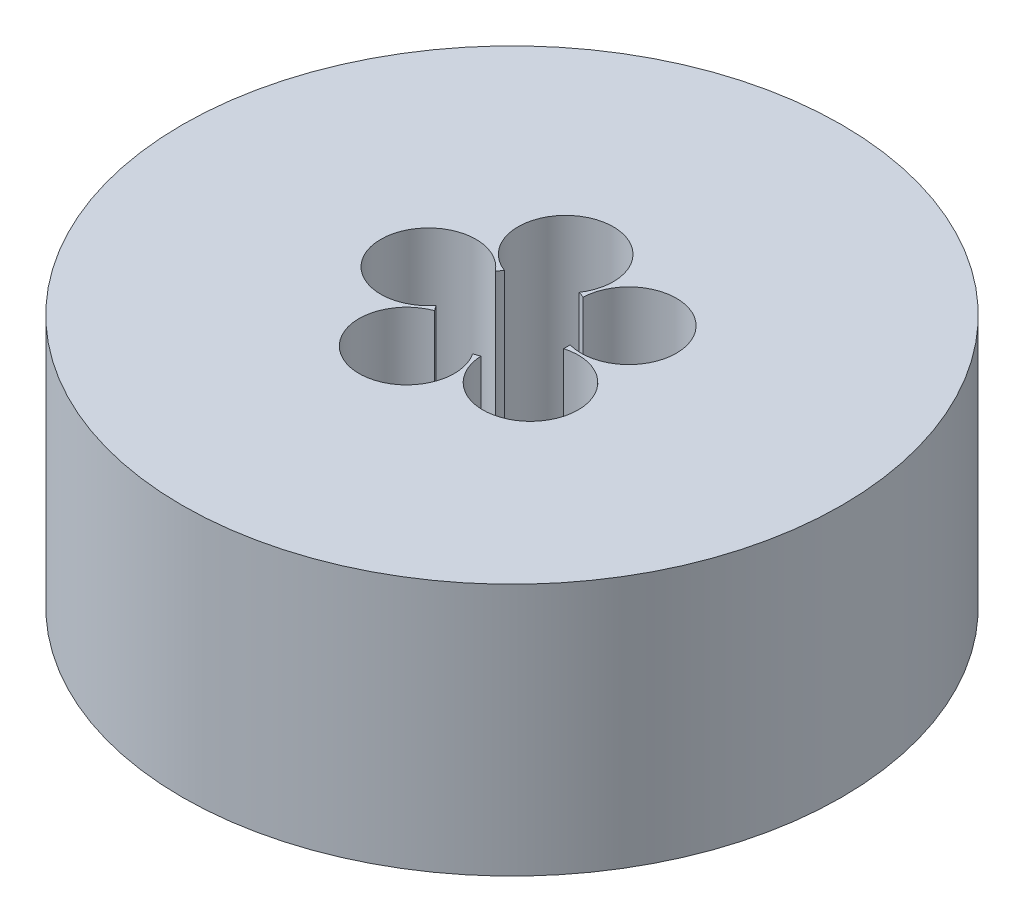
ISO-10303-21;
HEADER;
FILE_DESCRIPTION(('STEP AP214'),'2;1');
FILE_NAME('part.step','',(''),(''),'','','');
FILE_SCHEMA(('AUTOMOTIVE_DESIGN { 1 0 10303 214 1 1 1 1 }'));
ENDSEC;
DATA;
#1=APPLICATION_CONTEXT('core data for automotive mechanical design processes');
#2=APPLICATION_PROTOCOL_DEFINITION('international standard','automotive_design',2000,#1);
#3=PRODUCT_CONTEXT('',#1,'mechanical');
#4=PRODUCT('Part','Part','',(#3));
#5=PRODUCT_RELATED_PRODUCT_CATEGORY('part','',(#4));
#6=PRODUCT_DEFINITION_FORMATION('','',#4);
#7=PRODUCT_DEFINITION_CONTEXT('part definition',#1,'design');
#8=PRODUCT_DEFINITION('design','',#6,#7);
#9=PRODUCT_DEFINITION_SHAPE('','',#8);
#10=(LENGTH_UNIT() NAMED_UNIT(*) SI_UNIT(.MILLI.,.METRE.));
#11=(NAMED_UNIT(*) PLANE_ANGLE_UNIT() SI_UNIT($,.RADIAN.));
#12=(NAMED_UNIT(*) SI_UNIT($,.STERADIAN.) SOLID_ANGLE_UNIT());
#13=UNCERTAINTY_MEASURE_WITH_UNIT(LENGTH_MEASURE(1.E-05),#10,'distance_accuracy_value','');
#14=(GEOMETRIC_REPRESENTATION_CONTEXT(3) GLOBAL_UNCERTAINTY_ASSIGNED_CONTEXT((#13)) GLOBAL_UNIT_ASSIGNED_CONTEXT((#10,
#11,#12)) REPRESENTATION_CONTEXT('',''));
#15=CARTESIAN_POINT('',(0.,0.,0.));
#16=DIRECTION('',(0.,0.,1.));
#17=DIRECTION('',(1.,0.,0.));
#18=AXIS2_PLACEMENT_3D('',#15,#16,#17);
#19=CARTESIAN_POINT('',(0.,23.,0.));
#20=DIRECTION('',(0.,-1.,0.));
#21=DIRECTION('',(0.,0.,-1.));
#22=AXIS2_PLACEMENT_3D('',#19,#20,#21);
#23=CYLINDRICAL_SURFACE('',#22,30.);
#24=CARTESIAN_POINT('',(0.,23.,0.));
#25=DIRECTION('',(0.,1.,0.));
#26=DIRECTION('',(0.,0.,1.));
#27=AXIS2_PLACEMENT_3D('',#24,#25,#26);
#28=CIRCLE('',#27,30.);
#29=CARTESIAN_POINT('',(0.,23.,30.));
#30=VERTEX_POINT('',#29);
#31=EDGE_CURVE('E156',#30,#30,#28,.T.);
#32=ORIENTED_EDGE('',*,*,#31,.F.);
#33=EDGE_LOOP('',(#32));
#34=FACE_BOUND('',#33,.T.);
#35=CARTESIAN_POINT('',(0.,0.,0.));
#36=DIRECTION('',(0.,1.,0.));
#37=DIRECTION('',(0.,0.,1.));
#38=AXIS2_PLACEMENT_3D('',#35,#36,#37);
#39=CIRCLE('',#38,30.);
#40=CARTESIAN_POINT('',(0.,0.,30.));
#41=VERTEX_POINT('',#40);
#42=EDGE_CURVE('E145',#41,#41,#39,.T.);
#43=ORIENTED_EDGE('',*,*,#42,.T.);
#44=EDGE_LOOP('',(#43));
#45=FACE_BOUND('',#44,.T.);
#46=ADVANCED_FACE('F39',(#34,#45),#23,.T.);
#47=CARTESIAN_POINT('',(0.,23.,0.));
#48=DIRECTION('',(0.,1.,0.));
#49=DIRECTION('',(0.,0.,1.));
#50=AXIS2_PLACEMENT_3D('',#47,#48,#49);
#51=PLANE('',#50);
#52=CARTESIAN_POINT('',(6.15396144379872,23.,4.47111470462499));
#53=DIRECTION('',(0.,1.,0.));
#54=DIRECTION('',(0.587785252292469,0.,-0.809016994374951));
#55=AXIS2_PLACEMENT_3D('',#52,#53,#54);
#56=CIRCLE('',#55,4.33494273029872);
#57=CARTESIAN_POINT('',(1.82295628744294,23.,4.65583831055936));
#58=VERTEX_POINT('',#57);
#59=CARTESIAN_POINT('',(4.99128983689663,23.,0.29500129506899));
#60=VERTEX_POINT('',#59);
#61=EDGE_CURVE('E139',#58,#60,#56,.T.);
#62=ORIENTED_EDGE('',*,*,#61,.F.);
#63=CARTESIAN_POINT('',(0.,23.,0.));
#64=DIRECTION('',(0.,1.,0.));
#65=DIRECTION('',(0.,0.,1.));
#66=AXIS2_PLACEMENT_3D('',#63,#64,#65);
#67=CIRCLE('',#66,5.);
#68=CARTESIAN_POINT('',(1.26183047946113,23.,4.83815913763726));
#69=VERTEX_POINT('',#68);
#70=EDGE_CURVE('E132',#69,#58,#67,.T.);
#71=ORIENTED_EDGE('',*,*,#70,.F.);
#72=CARTESIAN_POINT('',(-2.35060410607471,23.,7.23441555968274));
#73=DIRECTION('',(0.,1.,0.));
#74=DIRECTION('',(0.951056516295155,0.,0.309016994374945));
#75=AXIS2_PLACEMENT_3D('',#72,#73,#74);
#76=CIRCLE('',#75,4.33494273029872);
#77=CARTESIAN_POINT('',(-3.86464089125158,23.,3.17246761711861));
#78=VERTEX_POINT('',#77);
#79=EDGE_CURVE('E111',#78,#69,#76,.T.);
#80=ORIENTED_EDGE('',*,*,#79,.F.);
#81=CARTESIAN_POINT('',(-4.21143571254908,23.,2.69514549497169));
#82=VERTEX_POINT('',#81);
#83=EDGE_CURVE('E143',#82,#78,#67,.T.);
#84=ORIENTED_EDGE('',*,*,#83,.F.);
#85=CARTESIAN_POINT('',(-7.60671467544794,23.,0.));
#86=DIRECTION('',(0.,1.,0.));
#87=DIRECTION('',(0.,0.,1.));
#88=AXIS2_PLACEMENT_3D('',#85,#86,#87);
#89=CIRCLE('',#88,4.33494273029872);
#90=CARTESIAN_POINT('',(-4.21143571254908,23.,-2.69514549497169));
#91=VERTEX_POINT('',#90);
#92=EDGE_CURVE('E147',#91,#82,#89,.T.);
#93=ORIENTED_EDGE('',*,*,#92,.F.);
#94=CARTESIAN_POINT('',(-3.86464089125162,23.,-3.17246761711855));
#95=VERTEX_POINT('',#94);
#96=EDGE_CURVE('E144',#95,#91,#67,.T.);
#97=ORIENTED_EDGE('',*,*,#96,.F.);
#98=CARTESIAN_POINT('',(-2.35060410607481,23.,-7.23441555968271));
#99=DIRECTION('',(0.,1.,0.));
#100=DIRECTION('',(-0.95105651629515,0.,0.309016994374958));
#101=AXIS2_PLACEMENT_3D('',#98,#99,#100);
#102=CIRCLE('',#101,4.33494273029872);
#103=CARTESIAN_POINT('',(1.26183047946106,23.,-4.83815913763728));
#104=VERTEX_POINT('',#103);
#105=EDGE_CURVE('E326',#104,#95,#102,.T.);
#106=ORIENTED_EDGE('',*,*,#105,.F.);
#107=CARTESIAN_POINT('',(1.82295628744288,23.,-4.65583831055939));
#108=VERTEX_POINT('',#107);
#109=EDGE_CURVE('E150',#108,#104,#67,.T.);
#110=ORIENTED_EDGE('',*,*,#109,.F.);
#111=CARTESIAN_POINT('',(6.15396144379866,23.,-4.47111470462508));
#112=DIRECTION('',(0.,1.,0.));
#113=DIRECTION('',(-0.58778525229248,0.,-0.809016994374942));
#114=AXIS2_PLACEMENT_3D('',#111,#112,#113);
#115=CIRCLE('',#114,4.33494273029872);
#116=CARTESIAN_POINT('',(4.99128983689663,23.,-0.295001295069062));
#117=VERTEX_POINT('',#116);
#118=EDGE_CURVE('E341',#117,#108,#115,.T.);
#119=ORIENTED_EDGE('',*,*,#118,.F.);
#120=EDGE_CURVE('E142',#60,#117,#67,.T.);
#121=ORIENTED_EDGE('',*,*,#120,.F.);
#122=EDGE_LOOP('',(#62,#71,#80,#84,#93,#97,#106,#110,#119,#121));
#123=FACE_BOUND('',#122,.T.);
#124=ORIENTED_EDGE('',*,*,#31,.T.);
#125=EDGE_LOOP('',(#124));
#126=FACE_BOUND('',#125,.T.);
#127=ADVANCED_FACE('F140',(#123,#126),#51,.T.);
#128=CARTESIAN_POINT('',(0.,0.,0.));
#129=DIRECTION('',(0.,1.,0.));
#130=DIRECTION('',(0.,0.,1.));
#131=AXIS2_PLACEMENT_3D('',#128,#129,#130);
#132=PLANE('',#131);
#133=CARTESIAN_POINT('',(0.,0.,0.));
#134=DIRECTION('',(0.,1.,0.));
#135=DIRECTION('',(0.,0.,1.));
#136=AXIS2_PLACEMENT_3D('',#133,#134,#135);
#137=CIRCLE('',#136,5.);
#138=CARTESIAN_POINT('',(0.,0.,5.));
#139=VERTEX_POINT('',#138);
#140=EDGE_CURVE('E155',#139,#139,#137,.T.);
#141=ORIENTED_EDGE('',*,*,#140,.T.);
#142=EDGE_LOOP('',(#141));
#143=FACE_BOUND('',#142,.T.);
#144=ORIENTED_EDGE('',*,*,#42,.F.);
#145=EDGE_LOOP('',(#144));
#146=FACE_BOUND('',#145,.T.);
#147=ADVANCED_FACE('F210',(#143,#146),#132,.F.);
#148=CARTESIAN_POINT('',(0.,23.,0.));
#149=DIRECTION('',(0.,-1.,0.));
#150=DIRECTION('',(0.,0.,-1.));
#151=AXIS2_PLACEMENT_3D('',#148,#149,#150);
#152=CYLINDRICAL_SURFACE('',#151,5.);
#153=DIRECTION('',(0.,1.,0.));
#154=VECTOR('',#153,1.);
#155=CARTESIAN_POINT('',(1.82295628744294,12.9826758487099,4.65583831055936));
#156=LINE('',#155,#154);
#157=CARTESIAN_POINT('',(1.82295628744294,2.96535169741985,4.65583831055936));
#158=VERTEX_POINT('',#157);
#159=EDGE_CURVE('E11',#158,#58,#156,.T.);
#160=ORIENTED_EDGE('',*,*,#159,.F.);
#161=CARTESIAN_POINT('',(0.,2.96535169741985,0.));
#162=DIRECTION('',(0.,1.,0.));
#163=DIRECTION('',(0.,0.,1.));
#164=AXIS2_PLACEMENT_3D('',#161,#162,#163);
#165=CIRCLE('',#164,5.);
#166=CARTESIAN_POINT('',(4.99128983689663,2.96535169741985,0.29500129506899));
#167=VERTEX_POINT('',#166);
#168=EDGE_CURVE('E190',#158,#167,#165,.T.);
#169=ORIENTED_EDGE('',*,*,#168,.T.);
#170=DIRECTION('',(0.,1.,0.));
#171=VECTOR('',#170,1.);
#172=CARTESIAN_POINT('',(4.99128983689663,12.9826758487099,0.29500129506899));
#173=LINE('',#172,#171);
#174=EDGE_CURVE('E46',#60,#167,#173,.F.);
#175=ORIENTED_EDGE('',*,*,#174,.F.);
#176=ORIENTED_EDGE('',*,*,#120,.T.);
#177=DIRECTION('',(0.,1.,0.));
#178=VECTOR('',#177,1.);
#179=CARTESIAN_POINT('',(4.99128983689663,12.9826758487099,-0.295001295069062));
#180=LINE('',#179,#178);
#181=CARTESIAN_POINT('',(4.99128983689663,2.96535169741985,-0.295001295069062));
#182=VERTEX_POINT('',#181);
#183=EDGE_CURVE('E183',#182,#117,#180,.T.);
#184=ORIENTED_EDGE('',*,*,#183,.F.);
#185=CARTESIAN_POINT('',(0.,2.96535169741985,0.));
#186=DIRECTION('',(0.,1.,0.));
#187=DIRECTION('',(0.,0.,1.));
#188=AXIS2_PLACEMENT_3D('',#185,#186,#187);
#189=CIRCLE('',#188,5.);
#190=CARTESIAN_POINT('',(1.82295628744288,2.96535169741985,-4.65583831055939));
#191=VERTEX_POINT('',#190);
#192=EDGE_CURVE('E179',#182,#191,#189,.T.);
#193=ORIENTED_EDGE('',*,*,#192,.T.);
#194=DIRECTION('',(0.,1.,0.));
#195=VECTOR('',#194,1.);
#196=CARTESIAN_POINT('',(1.82295628744288,12.9826758487099,-4.65583831055939));
#197=LINE('',#196,#195);
#198=EDGE_CURVE('E181',#108,#191,#197,.F.);
#199=ORIENTED_EDGE('',*,*,#198,.F.);
#200=ORIENTED_EDGE('',*,*,#109,.T.);
#201=DIRECTION('',(0.,1.,0.));
#202=VECTOR('',#201,1.);
#203=CARTESIAN_POINT('',(1.26183047946107,12.9826758487099,-4.83815913763728));
#204=LINE('',#203,#202);
#205=CARTESIAN_POINT('',(1.26183047946106,2.96535169741985,-4.83815913763728));
#206=VERTEX_POINT('',#205);
#207=EDGE_CURVE('E177',#206,#104,#204,.T.);
#208=ORIENTED_EDGE('',*,*,#207,.F.);
#209=CARTESIAN_POINT('',(0.,2.96535169741985,0.));
#210=DIRECTION('',(0.,1.,0.));
#211=DIRECTION('',(0.,0.,1.));
#212=AXIS2_PLACEMENT_3D('',#209,#210,#211);
#213=CIRCLE('',#212,5.);
#214=CARTESIAN_POINT('',(-3.86464089125162,2.96535169741985,-3.17246761711855));
#215=VERTEX_POINT('',#214);
#216=EDGE_CURVE('E175',#206,#215,#213,.T.);
#217=ORIENTED_EDGE('',*,*,#216,.T.);
#218=DIRECTION('',(0.,1.,0.));
#219=VECTOR('',#218,1.);
#220=CARTESIAN_POINT('',(-3.86464089125162,12.9826758487099,-3.17246761711855));
#221=LINE('',#220,#219);
#222=EDGE_CURVE('E174',#95,#215,#221,.F.);
#223=ORIENTED_EDGE('',*,*,#222,.F.);
#224=ORIENTED_EDGE('',*,*,#96,.T.);
#225=DIRECTION('',(0.,1.,0.));
#226=VECTOR('',#225,1.);
#227=CARTESIAN_POINT('',(-4.21143571254908,12.9826758487099,-2.69514549497169));
#228=LINE('',#227,#226);
#229=CARTESIAN_POINT('',(-4.21143571254908,2.96535169741985,-2.69514549497169));
#230=VERTEX_POINT('',#229);
#231=EDGE_CURVE('E170',#230,#91,#228,.T.);
#232=ORIENTED_EDGE('',*,*,#231,.F.);
#233=CARTESIAN_POINT('',(0.,2.96535169741985,0.));
#234=DIRECTION('',(0.,1.,0.));
#235=DIRECTION('',(0.,0.,1.));
#236=AXIS2_PLACEMENT_3D('',#233,#234,#235);
#237=CIRCLE('',#236,5.);
#238=CARTESIAN_POINT('',(-4.21143571254908,2.96535169741985,2.69514549497169));
#239=VERTEX_POINT('',#238);
#240=EDGE_CURVE('E157',#230,#239,#237,.T.);
#241=ORIENTED_EDGE('',*,*,#240,.T.);
#242=DIRECTION('',(0.,1.,0.));
#243=VECTOR('',#242,1.);
#244=CARTESIAN_POINT('',(-4.21143571254908,12.9826758487099,2.69514549497169));
#245=LINE('',#244,#243);
#246=EDGE_CURVE('E163',#82,#239,#245,.F.);
#247=ORIENTED_EDGE('',*,*,#246,.F.);
#248=ORIENTED_EDGE('',*,*,#83,.T.);
#249=DIRECTION('',(0.,1.,0.));
#250=VECTOR('',#249,1.);
#251=CARTESIAN_POINT('',(-3.86464089125158,12.9826758487099,3.17246761711861));
#252=LINE('',#251,#250);
#253=CARTESIAN_POINT('',(-3.86464089125158,2.96535169741985,3.17246761711861));
#254=VERTEX_POINT('',#253);
#255=EDGE_CURVE('E121',#254,#78,#252,.T.);
#256=ORIENTED_EDGE('',*,*,#255,.F.);
#257=CARTESIAN_POINT('',(0.,2.96535169741985,0.));
#258=DIRECTION('',(0.,1.,0.));
#259=DIRECTION('',(0.,0.,1.));
#260=AXIS2_PLACEMENT_3D('',#257,#258,#259);
#261=CIRCLE('',#260,5.);
#262=CARTESIAN_POINT('',(1.26183047946113,2.96535169741985,4.83815913763726));
#263=VERTEX_POINT('',#262);
#264=EDGE_CURVE('E133',#254,#263,#261,.T.);
#265=ORIENTED_EDGE('',*,*,#264,.T.);
#266=DIRECTION('',(0.,1.,0.));
#267=VECTOR('',#266,1.);
#268=CARTESIAN_POINT('',(1.26183047946113,12.9826758487099,4.83815913763726));
#269=LINE('',#268,#267);
#270=EDGE_CURVE('E117',#69,#263,#269,.F.);
#271=ORIENTED_EDGE('',*,*,#270,.F.);
#272=ORIENTED_EDGE('',*,*,#70,.T.);
#273=EDGE_LOOP('',(#160,#169,#175,#176,#184,#193,#199,#200,#208,#217,#223,#224,#232,#241,#247,
#248,#256,#265,#271,#272));
#274=FACE_BOUND('',#273,.T.);
#275=ORIENTED_EDGE('',*,*,#140,.F.);
#276=EDGE_LOOP('',(#275));
#277=FACE_BOUND('',#276,.T.);
#278=ADVANCED_FACE('F131',(#274,#277),#152,.F.);
#279=CARTESIAN_POINT('',(-7.60671467544794,2.96535169741985,0.));
#280=DIRECTION('',(0.,1.,0.));
#281=DIRECTION('',(0.,0.,1.));
#282=AXIS2_PLACEMENT_3D('',#279,#280,#281);
#283=CYLINDRICAL_SURFACE('',#282,4.33494273029872);
#284=ORIENTED_EDGE('',*,*,#231,.T.);
#285=ORIENTED_EDGE('',*,*,#92,.T.);
#286=ORIENTED_EDGE('',*,*,#246,.T.);
#287=CARTESIAN_POINT('',(-7.60671467544794,2.96535169741985,0.));
#288=DIRECTION('',(0.,1.,0.));
#289=DIRECTION('',(0.,0.,1.));
#290=AXIS2_PLACEMENT_3D('',#287,#288,#289);
#291=CIRCLE('',#290,4.33494273029872);
#292=EDGE_CURVE('E154',#230,#239,#291,.T.);
#293=ORIENTED_EDGE('',*,*,#292,.F.);
#294=EDGE_LOOP('',(#284,#285,#286,#293));
#295=FACE_BOUND('',#294,.T.);
#296=ADVANCED_FACE('F217',(#295),#283,.F.);
#297=CARTESIAN_POINT('',(-7.60671467544794,2.96535169741985,0.));
#298=DIRECTION('',(0.,1.,0.));
#299=DIRECTION('',(0.,0.,1.));
#300=AXIS2_PLACEMENT_3D('',#297,#298,#299);
#301=PLANE('',#300);
#302=ORIENTED_EDGE('',*,*,#292,.T.);
#303=ORIENTED_EDGE('',*,*,#240,.F.);
#304=EDGE_LOOP('',(#302,#303));
#305=FACE_BOUND('',#304,.T.);
#306=ADVANCED_FACE('F225',(#305),#301,.T.);
#307=CARTESIAN_POINT('',(-2.35060410607471,2.96535169741985,7.23441555968274));
#308=DIRECTION('',(0.,1.,0.));
#309=DIRECTION('',(0.,0.,1.));
#310=AXIS2_PLACEMENT_3D('',#307,#308,#309);
#311=CYLINDRICAL_SURFACE('',#310,4.33494273029872);
#312=ORIENTED_EDGE('',*,*,#255,.T.);
#313=ORIENTED_EDGE('',*,*,#79,.T.);
#314=ORIENTED_EDGE('',*,*,#270,.T.);
#315=CARTESIAN_POINT('',(-2.35060410607471,2.96535169741985,7.23441555968274));
#316=DIRECTION('',(0.,1.,0.));
#317=DIRECTION('',(0.951056516295155,0.,0.309016994374945));
#318=AXIS2_PLACEMENT_3D('',#315,#316,#317);
#319=CIRCLE('',#318,4.33494273029872);
#320=EDGE_CURVE('E127',#254,#263,#319,.T.);
#321=ORIENTED_EDGE('',*,*,#320,.F.);
#322=EDGE_LOOP('',(#312,#313,#314,#321));
#323=FACE_BOUND('',#322,.T.);
#324=ADVANCED_FACE('F116',(#323),#311,.F.);
#325=CARTESIAN_POINT('',(-2.35060410607471,2.96535169741985,7.23441555968274));
#326=DIRECTION('',(0.,1.,0.));
#327=DIRECTION('',(0.951056516295155,0.,0.309016994374945));
#328=AXIS2_PLACEMENT_3D('',#325,#326,#327);
#329=PLANE('',#328);
#330=ORIENTED_EDGE('',*,*,#320,.T.);
#331=ORIENTED_EDGE('',*,*,#264,.F.);
#332=EDGE_LOOP('',(#330,#331));
#333=FACE_BOUND('',#332,.T.);
#334=ADVANCED_FACE('F228',(#333),#329,.T.);
#335=CARTESIAN_POINT('',(-2.35060410607481,2.96535169741985,-7.23441555968271));
#336=DIRECTION('',(0.,1.,0.));
#337=DIRECTION('',(0.,0.,1.));
#338=AXIS2_PLACEMENT_3D('',#335,#336,#337);
#339=CYLINDRICAL_SURFACE('',#338,4.33494273029872);
#340=ORIENTED_EDGE('',*,*,#207,.T.);
#341=ORIENTED_EDGE('',*,*,#105,.T.);
#342=ORIENTED_EDGE('',*,*,#222,.T.);
#343=CARTESIAN_POINT('',(-2.35060410607481,2.96535169741985,-7.23441555968271));
#344=DIRECTION('',(0.,1.,0.));
#345=DIRECTION('',(-0.95105651629515,0.,0.309016994374958));
#346=AXIS2_PLACEMENT_3D('',#343,#344,#345);
#347=CIRCLE('',#346,4.33494273029872);
#348=EDGE_CURVE('E327',#206,#215,#347,.T.);
#349=ORIENTED_EDGE('',*,*,#348,.F.);
#350=EDGE_LOOP('',(#340,#341,#342,#349));
#351=FACE_BOUND('',#350,.T.);
#352=ADVANCED_FACE('F235',(#351),#339,.F.);
#353=CARTESIAN_POINT('',(-2.35060410607481,2.96535169741985,-7.23441555968271));
#354=DIRECTION('',(0.,1.,0.));
#355=DIRECTION('',(-0.95105651629515,0.,0.309016994374958));
#356=AXIS2_PLACEMENT_3D('',#353,#354,#355);
#357=PLANE('',#356);
#358=ORIENTED_EDGE('',*,*,#348,.T.);
#359=ORIENTED_EDGE('',*,*,#216,.F.);
#360=EDGE_LOOP('',(#358,#359));
#361=FACE_BOUND('',#360,.T.);
#362=ADVANCED_FACE('F240',(#361),#357,.T.);
#363=CARTESIAN_POINT('',(6.15396144379866,2.96535169741985,-4.47111470462508));
#364=DIRECTION('',(0.,1.,0.));
#365=DIRECTION('',(0.,0.,1.));
#366=AXIS2_PLACEMENT_3D('',#363,#364,#365);
#367=CYLINDRICAL_SURFACE('',#366,4.33494273029872);
#368=ORIENTED_EDGE('',*,*,#183,.T.);
#369=ORIENTED_EDGE('',*,*,#118,.T.);
#370=ORIENTED_EDGE('',*,*,#198,.T.);
#371=CARTESIAN_POINT('',(6.15396144379866,2.96535169741985,-4.47111470462508));
#372=DIRECTION('',(0.,1.,0.));
#373=DIRECTION('',(-0.58778525229248,0.,-0.809016994374942));
#374=AXIS2_PLACEMENT_3D('',#371,#372,#373);
#375=CIRCLE('',#374,4.33494273029872);
#376=EDGE_CURVE('E56',#182,#191,#375,.T.);
#377=ORIENTED_EDGE('',*,*,#376,.F.);
#378=EDGE_LOOP('',(#368,#369,#370,#377));
#379=FACE_BOUND('',#378,.T.);
#380=ADVANCED_FACE('F233',(#379),#367,.F.);
#381=CARTESIAN_POINT('',(6.15396144379866,2.96535169741985,-4.47111470462508));
#382=DIRECTION('',(0.,1.,0.));
#383=DIRECTION('',(-0.58778525229248,0.,-0.809016994374942));
#384=AXIS2_PLACEMENT_3D('',#381,#382,#383);
#385=PLANE('',#384);
#386=ORIENTED_EDGE('',*,*,#376,.T.);
#387=ORIENTED_EDGE('',*,*,#192,.F.);
#388=EDGE_LOOP('',(#386,#387));
#389=FACE_BOUND('',#388,.T.);
#390=ADVANCED_FACE('F196',(#389),#385,.T.);
#391=CARTESIAN_POINT('',(6.15396144379872,2.96535169741985,4.47111470462499));
#392=DIRECTION('',(0.,1.,0.));
#393=DIRECTION('',(0.,0.,1.));
#394=AXIS2_PLACEMENT_3D('',#391,#392,#393);
#395=CYLINDRICAL_SURFACE('',#394,4.33494273029872);
#396=ORIENTED_EDGE('',*,*,#159,.T.);
#397=ORIENTED_EDGE('',*,*,#61,.T.);
#398=ORIENTED_EDGE('',*,*,#174,.T.);
#399=CARTESIAN_POINT('',(6.15396144379872,2.96535169741985,4.47111470462499));
#400=DIRECTION('',(0.,1.,0.));
#401=DIRECTION('',(0.587785252292469,0.,-0.809016994374951));
#402=AXIS2_PLACEMENT_3D('',#399,#400,#401);
#403=CIRCLE('',#402,4.33494273029872);
#404=EDGE_CURVE('E55',#158,#167,#403,.T.);
#405=ORIENTED_EDGE('',*,*,#404,.F.);
#406=EDGE_LOOP('',(#396,#397,#398,#405));
#407=FACE_BOUND('',#406,.T.);
#408=ADVANCED_FACE('F191',(#407),#395,.F.);
#409=CARTESIAN_POINT('',(6.15396144379872,2.96535169741985,4.47111470462499));
#410=DIRECTION('',(0.,1.,0.));
#411=DIRECTION('',(0.587785252292469,0.,-0.809016994374951));
#412=AXIS2_PLACEMENT_3D('',#409,#410,#411);
#413=PLANE('',#412);
#414=ORIENTED_EDGE('',*,*,#404,.T.);
#415=ORIENTED_EDGE('',*,*,#168,.F.);
#416=EDGE_LOOP('',(#414,#415));
#417=FACE_BOUND('',#416,.T.);
#418=ADVANCED_FACE('F195',(#417),#413,.T.);
#419=CLOSED_SHELL('',(#46,#127,#147,#278,#296,#306,#324,#334,#352,#362,#380,#390,#408,#418));
#420=MANIFOLD_SOLID_BREP('B2',#419);
#421=ADVANCED_BREP_SHAPE_REPRESENTATION('',(#18,#420),#14);
#422=SHAPE_DEFINITION_REPRESENTATION(#9,#421);
ENDSEC;
END-ISO-10303-21;
